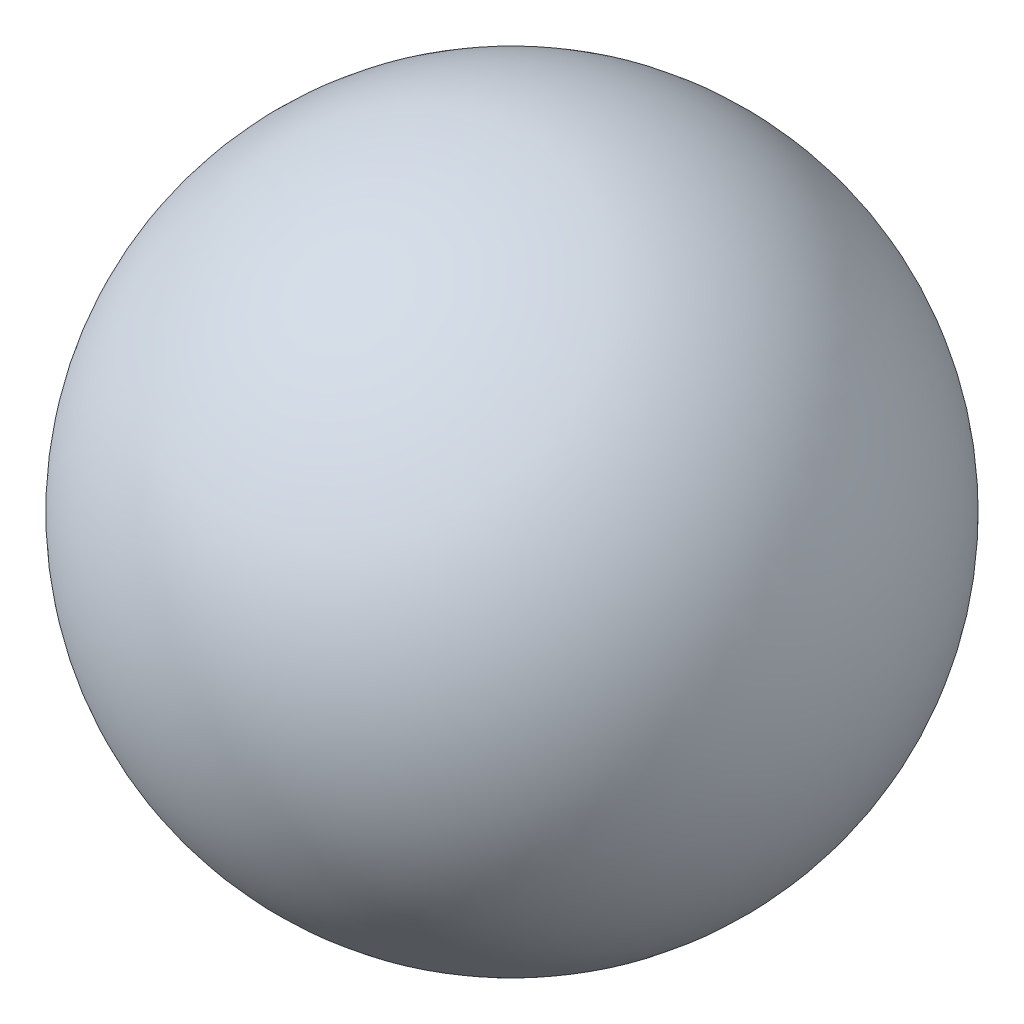
ISO-10303-21;
HEADER;
FILE_DESCRIPTION(('STEP AP214'),'2;1');
FILE_NAME('part.step','',(''),(''),'','','');
FILE_SCHEMA(('AUTOMOTIVE_DESIGN { 1 0 10303 214 1 1 1 1 }'));
ENDSEC;
DATA;
#1=APPLICATION_CONTEXT('core data for automotive mechanical design processes');
#2=APPLICATION_PROTOCOL_DEFINITION('international standard','automotive_design',2000,#1);
#3=PRODUCT_CONTEXT('',#1,'mechanical');
#4=PRODUCT('Part','Part','',(#3));
#5=PRODUCT_RELATED_PRODUCT_CATEGORY('part','',(#4));
#6=PRODUCT_DEFINITION_FORMATION('','',#4);
#7=PRODUCT_DEFINITION_CONTEXT('part definition',#1,'design');
#8=PRODUCT_DEFINITION('design','',#6,#7);
#9=PRODUCT_DEFINITION_SHAPE('','',#8);
#10=(LENGTH_UNIT() NAMED_UNIT(*) SI_UNIT(.MILLI.,.METRE.));
#11=(NAMED_UNIT(*) PLANE_ANGLE_UNIT() SI_UNIT($,.RADIAN.));
#12=(NAMED_UNIT(*) SI_UNIT($,.STERADIAN.) SOLID_ANGLE_UNIT());
#13=UNCERTAINTY_MEASURE_WITH_UNIT(LENGTH_MEASURE(1.E-05),#10,'distance_accuracy_value','');
#14=(GEOMETRIC_REPRESENTATION_CONTEXT(3) GLOBAL_UNCERTAINTY_ASSIGNED_CONTEXT((#13)) GLOBAL_UNIT_ASSIGNED_CONTEXT((#10,
#11,#12)) REPRESENTATION_CONTEXT('',''));
#15=CARTESIAN_POINT('',(0.,0.,0.));
#16=DIRECTION('',(0.,0.,1.));
#17=DIRECTION('',(1.,0.,0.));
#18=AXIS2_PLACEMENT_3D('',#15,#16,#17);
#19=CARTESIAN_POINT('',(0.,0.,0.));
#20=DIRECTION('',(0.,-1.,0.));
#21=DIRECTION('',(-1.,0.,0.));
#22=AXIS2_PLACEMENT_3D('',#19,#20,#21);
#23=SPHERICAL_SURFACE('',#22,25.);
#24=CARTESIAN_POINT('',(0.,-25.,0.));
#25=VERTEX_POINT('',#24);
#26=VERTEX_LOOP('',#25);
#27=FACE_BOUND('',#26,.T.);
#28=ADVANCED_FACE('F30',(#27),#23,.T.);
#29=CLOSED_SHELL('',(#28));
#30=MANIFOLD_SOLID_BREP('B2',#29);
#31=ADVANCED_BREP_SHAPE_REPRESENTATION('',(#18,#30),#14);
#32=SHAPE_DEFINITION_REPRESENTATION(#9,#31);
ENDSEC;
END-ISO-10303-21;
